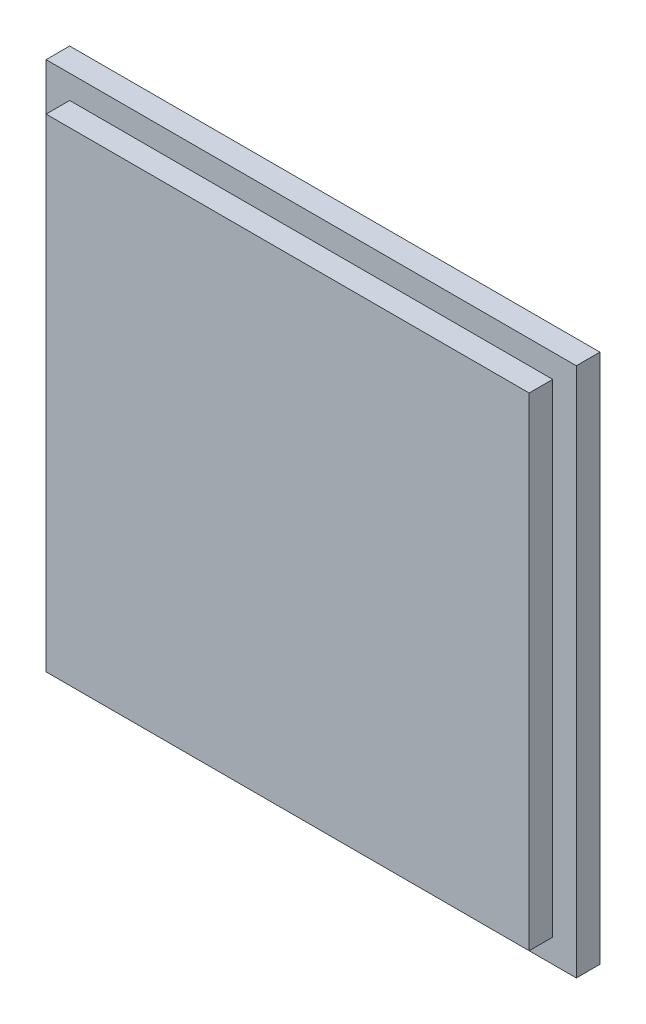
ISO-10303-21;
HEADER;
FILE_DESCRIPTION(('STEP AP214'),'2;1');
FILE_NAME('part.step','',(''),(''),'','','');
FILE_SCHEMA(('AUTOMOTIVE_DESIGN { 1 0 10303 214 1 1 1 1 }'));
ENDSEC;
DATA;
#1=APPLICATION_CONTEXT('core data for automotive mechanical design processes');
#2=APPLICATION_PROTOCOL_DEFINITION('international standard','automotive_design',2000,#1);
#3=PRODUCT_CONTEXT('',#1,'mechanical');
#4=PRODUCT('Part','Part','',(#3));
#5=PRODUCT_RELATED_PRODUCT_CATEGORY('part','',(#4));
#6=PRODUCT_DEFINITION_FORMATION('','',#4);
#7=PRODUCT_DEFINITION_CONTEXT('part definition',#1,'design');
#8=PRODUCT_DEFINITION('design','',#6,#7);
#9=PRODUCT_DEFINITION_SHAPE('','',#8);
#10=(LENGTH_UNIT() NAMED_UNIT(*) SI_UNIT(.MILLI.,.METRE.));
#11=(NAMED_UNIT(*) PLANE_ANGLE_UNIT() SI_UNIT($,.RADIAN.));
#12=(NAMED_UNIT(*) SI_UNIT($,.STERADIAN.) SOLID_ANGLE_UNIT());
#13=UNCERTAINTY_MEASURE_WITH_UNIT(LENGTH_MEASURE(1.E-05),#10,'distance_accuracy_value','');
#14=(GEOMETRIC_REPRESENTATION_CONTEXT(3) GLOBAL_UNCERTAINTY_ASSIGNED_CONTEXT((#13)) GLOBAL_UNIT_ASSIGNED_CONTEXT((#10,
#11,#12)) REPRESENTATION_CONTEXT('',''));
#15=CARTESIAN_POINT('',(0.,0.,0.));
#16=DIRECTION('',(0.,0.,1.));
#17=DIRECTION('',(1.,0.,0.));
#18=AXIS2_PLACEMENT_3D('',#15,#16,#17);
#19=CARTESIAN_POINT('',(0.,0.,1.));
#20=DIRECTION('',(0.,0.,-1.));
#21=DIRECTION('',(-1.,0.,0.));
#22=AXIS2_PLACEMENT_3D('',#19,#20,#21);
#23=PLANE('',#22);
#24=DIRECTION('',(0.500000000000017,0.866025403784429,0.));
#25=VECTOR('',#24,1.);
#26=CARTESIAN_POINT('',(-17.3205080756894,-9.99999999999985,1.));
#27=LINE('',#26,#25);
#28=CARTESIAN_POINT('',(-17.3205080756894,-9.99999999999985,1.));
#29=VERTEX_POINT('',#28);
#30=CARTESIAN_POINT('',(0.,20.,1.));
#31=VERTEX_POINT('',#30);
#32=EDGE_CURVE('E226',#29,#31,#27,.T.);
#33=ORIENTED_EDGE('',*,*,#32,.T.);
#34=DIRECTION('',(0.500000000000007,-0.866025403784434,0.));
#35=VECTOR('',#34,1.);
#36=CARTESIAN_POINT('',(0.,20.,1.));
#37=LINE('',#36,#35);
#38=CARTESIAN_POINT('',(17.3205080756889,-9.99999999999971,1.));
#39=VERTEX_POINT('',#38);
#40=EDGE_CURVE('E230',#31,#39,#37,.T.);
#41=ORIENTED_EDGE('',*,*,#40,.T.);
#42=DIRECTION('',(-1.,0.,0.));
#43=VECTOR('',#42,1.);
#44=CARTESIAN_POINT('',(-17.3205080756894,-9.99999999999985,1.));
#45=LINE('',#44,#43);
#46=EDGE_CURVE('E235',#39,#29,#45,.T.);
#47=ORIENTED_EDGE('',*,*,#46,.T.);
#48=EDGE_LOOP('',(#33,#41,#47));
#49=FACE_BOUND('',#48,.T.);
#50=DIRECTION('',(0.350126618263012,-0.936702381327018,0.));
#51=VECTOR('',#50,1.);
#52=CARTESIAN_POINT('',(1.51775564227952,12.4614953306966,1.));
#53=LINE('',#52,#51);
#54=CARTESIAN_POINT('',(1.51775564227952,12.4614953306966,1.));
#55=VERTEX_POINT('',#54);
#56=CARTESIAN_POINT('',(5.56161090099694,1.64286957360848,1.));
#57=VERTEX_POINT('',#56);
#58=EDGE_CURVE('E588',#55,#57,#53,.T.);
#59=ORIENTED_EDGE('',*,*,#58,.F.);
#60=DIRECTION('',(0.999634969872854,0.0270171613479146,0.));
#61=VECTOR('',#60,1.);
#62=CARTESIAN_POINT('',(-2.3685468141502,12.3564601291715,1.));
#63=LINE('',#62,#61);
#64=CARTESIAN_POINT('',(-2.3685468141502,12.3564601291715,1.));
#65=VERTEX_POINT('',#64);
#66=EDGE_CURVE('E214',#65,#55,#63,.T.);
#67=ORIENTED_EDGE('',*,*,#66,.F.);
#68=DIRECTION('',(-0.459765561217059,0.888040330569937,0.));
#69=VECTOR('',#68,1.);
#70=CARTESIAN_POINT('',(1.46523804151696,4.95147842165001,1.));
#71=LINE('',#70,#69);
#72=CARTESIAN_POINT('',(1.46523804151696,4.95147842165001,1.));
#73=VERTEX_POINT('',#72);
#74=EDGE_CURVE('E210',#73,#65,#71,.T.);
#75=ORIENTED_EDGE('',*,*,#74,.F.);
#76=DIRECTION('',(0.999261174631314,-0.0384331221012039,0.));
#77=VECTOR('',#76,1.);
#78=CARTESIAN_POINT('',(-2.63113481796302,5.1090312239377,1.));
#79=LINE('',#78,#77);
#80=CARTESIAN_POINT('',(-2.63113481796302,5.1090312239377,1.));
#81=VERTEX_POINT('',#80);
#82=EDGE_CURVE('E583',#81,#73,#79,.T.);
#83=ORIENTED_EDGE('',*,*,#82,.F.);
#84=DIRECTION('',(-0.365795626746884,0.930695202229416,0.));
#85=VECTOR('',#84,1.);
#86=CARTESIAN_POINT('',(1.51775564227952,-5.44700652933764,1.));
#87=LINE('',#86,#85);
#88=CARTESIAN_POINT('',(1.51775564227952,-5.44700652933764,1.));
#89=VERTEX_POINT('',#88);
#90=EDGE_CURVE('E614',#89,#81,#87,.T.);
#91=ORIENTED_EDGE('',*,*,#90,.F.);
#92=DIRECTION('',(1.,0.,0.));
#93=VECTOR('',#92,1.);
#94=CARTESIAN_POINT('',(-0.320360384410214,-5.44700652933764,1.));
#95=LINE('',#94,#93);
#96=CARTESIAN_POINT('',(-0.320360384410214,-5.44700652933764,1.));
#97=VERTEX_POINT('',#96);
#98=EDGE_CURVE('E611',#97,#89,#95,.T.);
#99=ORIENTED_EDGE('',*,*,#98,.F.);
#100=DIRECTION('',(-0.776458094390115,0.630168888200673,0.));
#101=VECTOR('',#100,1.);
#102=CARTESIAN_POINT('',(3.3033540682067,-8.38799217204122,1.));
#103=LINE('',#102,#101);
#104=CARTESIAN_POINT('',(3.3033540682067,-8.38799217204122,1.));
#105=VERTEX_POINT('',#104);
#106=EDGE_CURVE('E608',#105,#97,#103,.T.);
#107=ORIENTED_EDGE('',*,*,#106,.F.);
#108=DIRECTION('',(-0.185606774758075,-0.982624101660398,0.));
#109=VECTOR('',#108,1.);
#110=CARTESIAN_POINT('',(4.19615328117028,-3.66140810341047,1.));
#111=LINE('',#110,#109);
#112=CARTESIAN_POINT('',(4.19615328117028,-3.66140810341047,1.));
#113=VERTEX_POINT('',#112);
#114=EDGE_CURVE('E605',#113,#105,#111,.T.);
#115=ORIENTED_EDGE('',*,*,#114,.F.);
#116=DIRECTION('',(0.72138732103095,0.692531828189714,0.));
#117=VECTOR('',#116,1.);
#118=CARTESIAN_POINT('',(2.88321326210618,-4.92183052171201,1.));
#119=LINE('',#118,#117);
#120=CARTESIAN_POINT('',(2.88321326210618,-4.92183052171201,1.));
#121=VERTEX_POINT('',#120);
#122=EDGE_CURVE('E602',#121,#113,#119,.T.);
#123=ORIENTED_EDGE('',*,*,#122,.F.);
#124=DIRECTION('',(0.309649536219728,-0.950850758383726,0.));
#125=VECTOR('',#124,1.);
#126=CARTESIAN_POINT('',(0.574357926212733,2.16804558123412,1.));
#127=LINE('',#126,#125);
#128=CARTESIAN_POINT('',(0.574357926212733,2.16804558123412,1.));
#129=VERTEX_POINT('',#128);
#130=EDGE_CURVE('E599',#129,#121,#127,.T.);
#131=ORIENTED_EDGE('',*,*,#130,.F.);
#132=DIRECTION('',(-0.994501258319248,0.104724625573134,0.));
#133=VECTOR('',#132,1.);
#134=CARTESIAN_POINT('',(5.56161090099694,1.64286957360848,1.));
#135=LINE('',#134,#133);
#136=EDGE_CURVE('E592',#57,#129,#135,.T.);
#137=ORIENTED_EDGE('',*,*,#136,.F.);
#138=EDGE_LOOP('',(#59,#67,#75,#83,#91,#99,#107,#115,#123,#131,#137));
#139=FACE_BOUND('',#138,.T.);
#140=ADVANCED_FACE('F39',(#49,#139),#23,.T.);
#141=CARTESIAN_POINT('',(0.,0.,2.5));
#142=DIRECTION('',(0.,0.,-1.));
#143=DIRECTION('',(-1.,0.,0.));
#144=AXIS2_PLACEMENT_3D('',#141,#142,#143);
#145=PLANE('',#144);
#146=DIRECTION('',(0.,1.,0.));
#147=VECTOR('',#146,1.);
#148=CARTESIAN_POINT('',(28.1,-28.1,2.5));
#149=LINE('',#148,#147);
#150=CARTESIAN_POINT('',(28.1,-28.1,2.5));
#151=VERTEX_POINT('',#150);
#152=CARTESIAN_POINT('',(28.1,28.1,2.5));
#153=VERTEX_POINT('',#152);
#154=EDGE_CURVE('E300',#151,#153,#149,.T.);
#155=ORIENTED_EDGE('',*,*,#154,.T.);
#156=DIRECTION('',(-1.,0.,0.));
#157=VECTOR('',#156,1.);
#158=CARTESIAN_POINT('',(-28.1,28.1,2.5));
#159=LINE('',#158,#157);
#160=CARTESIAN_POINT('',(-28.1,28.1,2.5));
#161=VERTEX_POINT('',#160);
#162=EDGE_CURVE('E304',#153,#161,#159,.T.);
#163=ORIENTED_EDGE('',*,*,#162,.T.);
#164=DIRECTION('',(0.,-1.,0.));
#165=VECTOR('',#164,1.);
#166=CARTESIAN_POINT('',(-28.1,-28.1,2.5));
#167=LINE('',#166,#165);
#168=CARTESIAN_POINT('',(-28.1,-28.1,2.5));
#169=VERTEX_POINT('',#168);
#170=EDGE_CURVE('E308',#161,#169,#167,.T.);
#171=ORIENTED_EDGE('',*,*,#170,.T.);
#172=DIRECTION('',(1.,0.,0.));
#173=VECTOR('',#172,1.);
#174=CARTESIAN_POINT('',(-28.1,-28.1,2.5));
#175=LINE('',#174,#173);
#176=EDGE_CURVE('E311',#169,#151,#175,.T.);
#177=ORIENTED_EDGE('',*,*,#176,.T.);
#178=EDGE_LOOP('',(#155,#163,#171,#177));
#179=FACE_BOUND('',#178,.T.);
#180=DIRECTION('',(0.,1.,0.));
#181=VECTOR('',#180,1.);
#182=CARTESIAN_POINT('',(25.6,-25.6,2.5));
#183=LINE('',#182,#181);
#184=CARTESIAN_POINT('',(25.6,-25.6,2.5));
#185=VERTEX_POINT('',#184);
#186=CARTESIAN_POINT('',(25.6,25.6,2.5));
#187=VERTEX_POINT('',#186);
#188=EDGE_CURVE('E249',#185,#187,#183,.T.);
#189=ORIENTED_EDGE('',*,*,#188,.F.);
#190=DIRECTION('',(1.,0.,0.));
#191=VECTOR('',#190,1.);
#192=CARTESIAN_POINT('',(-25.6,-25.6,2.5));
#193=LINE('',#192,#191);
#194=CARTESIAN_POINT('',(-25.6,-25.6,2.5));
#195=VERTEX_POINT('',#194);
#196=EDGE_CURVE('E260',#195,#185,#193,.T.);
#197=ORIENTED_EDGE('',*,*,#196,.F.);
#198=DIRECTION('',(0.,-1.,0.));
#199=VECTOR('',#198,1.);
#200=CARTESIAN_POINT('',(-25.6,-25.6,2.5));
#201=LINE('',#200,#199);
#202=CARTESIAN_POINT('',(-25.6,25.6,2.5));
#203=VERTEX_POINT('',#202);
#204=EDGE_CURVE('E277',#203,#195,#201,.T.);
#205=ORIENTED_EDGE('',*,*,#204,.F.);
#206=DIRECTION('',(-1.,0.,0.));
#207=VECTOR('',#206,1.);
#208=CARTESIAN_POINT('',(-25.6,25.6,2.5));
#209=LINE('',#208,#207);
#210=EDGE_CURVE('E273',#187,#203,#209,.T.);
#211=ORIENTED_EDGE('',*,*,#210,.F.);
#212=EDGE_LOOP('',(#189,#197,#205,#211));
#213=FACE_BOUND('',#212,.T.);
#214=ADVANCED_FACE('F353',(#179,#213),#145,.F.);
#215=CARTESIAN_POINT('',(28.1,-28.1,2.5));
#216=DIRECTION('',(-1.,0.,0.));
#217=DIRECTION('',(0.,0.,1.));
#218=AXIS2_PLACEMENT_3D('',#215,#216,#217);
#219=PLANE('',#218);
#220=DIRECTION('',(0.,1.,0.));
#221=VECTOR('',#220,1.);
#222=CARTESIAN_POINT('',(28.1,-28.1,0.));
#223=LINE('',#222,#221);
#224=CARTESIAN_POINT('',(28.1,-28.1,0.));
#225=VERTEX_POINT('',#224);
#226=CARTESIAN_POINT('',(28.1,28.1,0.));
#227=VERTEX_POINT('',#226);
#228=EDGE_CURVE('E299',#225,#227,#223,.T.);
#229=ORIENTED_EDGE('',*,*,#228,.T.);
#230=DIRECTION('',(0.,0.,-1.));
#231=VECTOR('',#230,1.);
#232=CARTESIAN_POINT('',(28.1,28.1,2.5));
#233=LINE('',#232,#231);
#234=EDGE_CURVE('E11',#153,#227,#233,.T.);
#235=ORIENTED_EDGE('',*,*,#234,.F.);
#236=ORIENTED_EDGE('',*,*,#154,.F.);
#237=DIRECTION('',(0.,0.,-1.));
#238=VECTOR('',#237,1.);
#239=CARTESIAN_POINT('',(28.1,-28.1,2.5));
#240=LINE('',#239,#238);
#241=EDGE_CURVE('E314',#151,#225,#240,.T.);
#242=ORIENTED_EDGE('',*,*,#241,.T.);
#243=EDGE_LOOP('',(#229,#235,#236,#242));
#244=FACE_BOUND('',#243,.T.);
#245=ADVANCED_FACE('F41',(#244),#219,.F.);
#246=CARTESIAN_POINT('',(-28.1,28.1,2.5));
#247=DIRECTION('',(0.,-1.,0.));
#248=DIRECTION('',(0.,0.,-1.));
#249=AXIS2_PLACEMENT_3D('',#246,#247,#248);
#250=PLANE('',#249);
#251=DIRECTION('',(-1.,0.,0.));
#252=VECTOR('',#251,1.);
#253=CARTESIAN_POINT('',(-28.1,28.1,0.));
#254=LINE('',#253,#252);
#255=CARTESIAN_POINT('',(-28.1,28.1,0.));
#256=VERTEX_POINT('',#255);
#257=EDGE_CURVE('E318',#227,#256,#254,.T.);
#258=ORIENTED_EDGE('',*,*,#257,.T.);
#259=DIRECTION('',(0.,0.,-1.));
#260=VECTOR('',#259,1.);
#261=CARTESIAN_POINT('',(-28.1,28.1,2.5));
#262=LINE('',#261,#260);
#263=EDGE_CURVE('E48',#161,#256,#262,.T.);
#264=ORIENTED_EDGE('',*,*,#263,.F.);
#265=ORIENTED_EDGE('',*,*,#162,.F.);
#266=ORIENTED_EDGE('',*,*,#234,.T.);
#267=EDGE_LOOP('',(#258,#264,#265,#266));
#268=FACE_BOUND('',#267,.T.);
#269=ADVANCED_FACE('F355',(#268),#250,.F.);
#270=CARTESIAN_POINT('',(-28.1,-28.1,2.5));
#271=DIRECTION('',(1.,0.,0.));
#272=DIRECTION('',(0.,0.,-1.));
#273=AXIS2_PLACEMENT_3D('',#270,#271,#272);
#274=PLANE('',#273);
#275=DIRECTION('',(0.,-1.,0.));
#276=VECTOR('',#275,1.);
#277=CARTESIAN_POINT('',(-28.1,-28.1,0.));
#278=LINE('',#277,#276);
#279=CARTESIAN_POINT('',(-28.1,-28.1,0.));
#280=VERTEX_POINT('',#279);
#281=EDGE_CURVE('E321',#256,#280,#278,.T.);
#282=ORIENTED_EDGE('',*,*,#281,.T.);
#283=DIRECTION('',(0.,0.,-1.));
#284=VECTOR('',#283,1.);
#285=CARTESIAN_POINT('',(-28.1,-28.1,2.5));
#286=LINE('',#285,#284);
#287=EDGE_CURVE('E329',#169,#280,#286,.T.);
#288=ORIENTED_EDGE('',*,*,#287,.F.);
#289=ORIENTED_EDGE('',*,*,#170,.F.);
#290=ORIENTED_EDGE('',*,*,#263,.T.);
#291=EDGE_LOOP('',(#282,#288,#289,#290));
#292=FACE_BOUND('',#291,.T.);
#293=ADVANCED_FACE('F338',(#292),#274,.F.);
#294=CARTESIAN_POINT('',(-28.1,-28.1,2.5));
#295=DIRECTION('',(0.,1.,0.));
#296=DIRECTION('',(-1.,0.,0.));
#297=AXIS2_PLACEMENT_3D('',#294,#295,#296);
#298=PLANE('',#297);
#299=DIRECTION('',(1.,0.,0.));
#300=VECTOR('',#299,1.);
#301=CARTESIAN_POINT('',(-28.1,-28.1,0.));
#302=LINE('',#301,#300);
#303=EDGE_CURVE('E305',#280,#225,#302,.T.);
#304=ORIENTED_EDGE('',*,*,#303,.T.);
#305=ORIENTED_EDGE('',*,*,#241,.F.);
#306=ORIENTED_EDGE('',*,*,#176,.F.);
#307=ORIENTED_EDGE('',*,*,#287,.T.);
#308=EDGE_LOOP('',(#304,#305,#306,#307));
#309=FACE_BOUND('',#308,.T.);
#310=ADVANCED_FACE('F347',(#309),#298,.F.);
#311=CARTESIAN_POINT('',(0.,0.,0.));
#312=DIRECTION('',(0.,0.,-1.));
#313=DIRECTION('',(-1.,0.,0.));
#314=AXIS2_PLACEMENT_3D('',#311,#312,#313);
#315=PLANE('',#314);
#316=DIRECTION('',(0.500000000000017,0.866025403784429,0.));
#317=VECTOR('',#316,1.);
#318=CARTESIAN_POINT('',(-17.3205080756894,-9.99999999999985,0.));
#319=LINE('',#318,#317);
#320=CARTESIAN_POINT('',(-17.3205080756894,-9.99999999999985,0.));
#321=VERTEX_POINT('',#320);
#322=CARTESIAN_POINT('',(0.,20.,0.));
#323=VERTEX_POINT('',#322);
#324=EDGE_CURVE('E63',#321,#323,#319,.T.);
#325=ORIENTED_EDGE('',*,*,#324,.F.);
#326=DIRECTION('',(-1.,0.,0.));
#327=VECTOR('',#326,1.);
#328=CARTESIAN_POINT('',(-17.3205080756894,-9.99999999999985,0.));
#329=LINE('',#328,#327);
#330=CARTESIAN_POINT('',(17.3205080756889,-9.99999999999971,0.));
#331=VERTEX_POINT('',#330);
#332=EDGE_CURVE('E231',#331,#321,#329,.T.);
#333=ORIENTED_EDGE('',*,*,#332,.F.);
#334=DIRECTION('',(0.500000000000007,-0.866025403784434,0.));
#335=VECTOR('',#334,1.);
#336=CARTESIAN_POINT('',(0.,20.,0.));
#337=LINE('',#336,#335);
#338=EDGE_CURVE('E220',#323,#331,#337,.T.);
#339=ORIENTED_EDGE('',*,*,#338,.F.);
#340=EDGE_LOOP('',(#325,#333,#339));
#341=FACE_BOUND('',#340,.T.);
#342=ORIENTED_EDGE('',*,*,#228,.F.);
#343=ORIENTED_EDGE('',*,*,#303,.F.);
#344=ORIENTED_EDGE('',*,*,#281,.F.);
#345=ORIENTED_EDGE('',*,*,#257,.F.);
#346=EDGE_LOOP('',(#342,#343,#344,#345));
#347=FACE_BOUND('',#346,.T.);
#348=ADVANCED_FACE('F344',(#341,#347),#315,.T.);
#349=CARTESIAN_POINT('',(25.6,-25.6,5.));
#350=DIRECTION('',(-1.,0.,0.));
#351=DIRECTION('',(0.,0.,1.));
#352=AXIS2_PLACEMENT_3D('',#349,#350,#351);
#353=PLANE('',#352);
#354=ORIENTED_EDGE('',*,*,#188,.T.);
#355=DIRECTION('',(0.,0.,-1.));
#356=VECTOR('',#355,1.);
#357=CARTESIAN_POINT('',(25.6,25.6,5.));
#358=LINE('',#357,#356);
#359=CARTESIAN_POINT('',(25.6,25.6,5.));
#360=VERTEX_POINT('',#359);
#361=EDGE_CURVE('E295',#360,#187,#358,.T.);
#362=ORIENTED_EDGE('',*,*,#361,.F.);
#363=DIRECTION('',(0.,1.,0.));
#364=VECTOR('',#363,1.);
#365=CARTESIAN_POINT('',(25.6,-25.6,5.));
#366=LINE('',#365,#364);
#367=CARTESIAN_POINT('',(25.6,-25.6,5.));
#368=VERTEX_POINT('',#367);
#369=EDGE_CURVE('E255',#368,#360,#366,.T.);
#370=ORIENTED_EDGE('',*,*,#369,.F.);
#371=DIRECTION('',(0.,0.,-1.));
#372=VECTOR('',#371,1.);
#373=CARTESIAN_POINT('',(25.6,-25.6,5.));
#374=LINE('',#373,#372);
#375=EDGE_CURVE('E269',#368,#185,#374,.T.);
#376=ORIENTED_EDGE('',*,*,#375,.T.);
#377=EDGE_LOOP('',(#354,#362,#370,#376));
#378=FACE_BOUND('',#377,.T.);
#379=ADVANCED_FACE('F399',(#378),#353,.F.);
#380=CARTESIAN_POINT('',(-25.6,25.6,5.));
#381=DIRECTION('',(0.,-1.,0.));
#382=DIRECTION('',(0.,0.,-1.));
#383=AXIS2_PLACEMENT_3D('',#380,#381,#382);
#384=PLANE('',#383);
#385=ORIENTED_EDGE('',*,*,#210,.T.);
#386=DIRECTION('',(0.,0.,-1.));
#387=VECTOR('',#386,1.);
#388=CARTESIAN_POINT('',(-25.6,25.6,5.));
#389=LINE('',#388,#387);
#390=CARTESIAN_POINT('',(-25.6,25.6,5.));
#391=VERTEX_POINT('',#390);
#392=EDGE_CURVE('E291',#391,#203,#389,.T.);
#393=ORIENTED_EDGE('',*,*,#392,.F.);
#394=DIRECTION('',(-1.,0.,0.));
#395=VECTOR('',#394,1.);
#396=CARTESIAN_POINT('',(-25.6,25.6,5.));
#397=LINE('',#396,#395);
#398=EDGE_CURVE('E259',#360,#391,#397,.T.);
#399=ORIENTED_EDGE('',*,*,#398,.F.);
#400=ORIENTED_EDGE('',*,*,#361,.T.);
#401=EDGE_LOOP('',(#385,#393,#399,#400));
#402=FACE_BOUND('',#401,.T.);
#403=ADVANCED_FACE('F395',(#402),#384,.F.);
#404=CARTESIAN_POINT('',(-25.6,-25.6,5.));
#405=DIRECTION('',(1.,0.,0.));
#406=DIRECTION('',(0.,0.,-1.));
#407=AXIS2_PLACEMENT_3D('',#404,#405,#406);
#408=PLANE('',#407);
#409=ORIENTED_EDGE('',*,*,#204,.T.);
#410=DIRECTION('',(0.,0.,-1.));
#411=VECTOR('',#410,1.);
#412=CARTESIAN_POINT('',(-25.6,-25.6,5.));
#413=LINE('',#412,#411);
#414=CARTESIAN_POINT('',(-25.6,-25.6,5.));
#415=VERTEX_POINT('',#414);
#416=EDGE_CURVE('E287',#415,#195,#413,.T.);
#417=ORIENTED_EDGE('',*,*,#416,.F.);
#418=DIRECTION('',(0.,-1.,0.));
#419=VECTOR('',#418,1.);
#420=CARTESIAN_POINT('',(-25.6,-25.6,5.));
#421=LINE('',#420,#419);
#422=EDGE_CURVE('E263',#391,#415,#421,.T.);
#423=ORIENTED_EDGE('',*,*,#422,.F.);
#424=ORIENTED_EDGE('',*,*,#392,.T.);
#425=EDGE_LOOP('',(#409,#417,#423,#424));
#426=FACE_BOUND('',#425,.T.);
#427=ADVANCED_FACE('F391',(#426),#408,.F.);
#428=CARTESIAN_POINT('',(-25.6,-25.6,5.));
#429=DIRECTION('',(0.,1.,0.));
#430=DIRECTION('',(0.,0.,1.));
#431=AXIS2_PLACEMENT_3D('',#428,#429,#430);
#432=PLANE('',#431);
#433=ORIENTED_EDGE('',*,*,#196,.T.);
#434=ORIENTED_EDGE('',*,*,#375,.F.);
#435=DIRECTION('',(1.,0.,0.));
#436=VECTOR('',#435,1.);
#437=CARTESIAN_POINT('',(-25.6,-25.6,5.));
#438=LINE('',#437,#436);
#439=EDGE_CURVE('E266',#415,#368,#438,.T.);
#440=ORIENTED_EDGE('',*,*,#439,.F.);
#441=ORIENTED_EDGE('',*,*,#416,.T.);
#442=EDGE_LOOP('',(#433,#434,#440,#441));
#443=FACE_BOUND('',#442,.T.);
#444=ADVANCED_FACE('F387',(#443),#432,.F.);
#445=CARTESIAN_POINT('',(0.,0.,5.));
#446=DIRECTION('',(0.,0.,-1.));
#447=DIRECTION('',(-1.,0.,0.));
#448=AXIS2_PLACEMENT_3D('',#445,#446,#447);
#449=PLANE('',#448);
#450=ORIENTED_EDGE('',*,*,#369,.T.);
#451=ORIENTED_EDGE('',*,*,#398,.T.);
#452=ORIENTED_EDGE('',*,*,#422,.T.);
#453=ORIENTED_EDGE('',*,*,#439,.T.);
#454=EDGE_LOOP('',(#450,#451,#452,#453));
#455=FACE_BOUND('',#454,.T.);
#456=ADVANCED_FACE('F385',(#455),#449,.F.);
#457=CARTESIAN_POINT('',(-17.3205080756894,-9.99999999999985,1.));
#458=DIRECTION('',(-0.866025403784429,0.500000000000017,0.));
#459=DIRECTION('',(-0.500000000000017,-0.866025403784429,0.));
#460=AXIS2_PLACEMENT_3D('',#457,#458,#459);
#461=PLANE('',#460);
#462=ORIENTED_EDGE('',*,*,#324,.T.);
#463=DIRECTION('',(0.,0.,-1.));
#464=VECTOR('',#463,1.);
#465=CARTESIAN_POINT('',(0.,20.,1.));
#466=LINE('',#465,#464);
#467=EDGE_CURVE('E238',#31,#323,#466,.T.);
#468=ORIENTED_EDGE('',*,*,#467,.F.);
#469=ORIENTED_EDGE('',*,*,#32,.F.);
#470=DIRECTION('',(0.,0.,-1.));
#471=VECTOR('',#470,1.);
#472=CARTESIAN_POINT('',(-17.3205080756894,-9.99999999999985,1.));
#473=LINE('',#472,#471);
#474=EDGE_CURVE('E246',#29,#321,#473,.T.);
#475=ORIENTED_EDGE('',*,*,#474,.T.);
#476=EDGE_LOOP('',(#462,#468,#469,#475));
#477=FACE_BOUND('',#476,.T.);
#478=ADVANCED_FACE('F379',(#477),#461,.F.);
#479=CARTESIAN_POINT('',(-17.3205080756894,-9.99999999999985,1.));
#480=DIRECTION('',(0.,-1.,0.));
#481=DIRECTION('',(1.,0.,0.));
#482=AXIS2_PLACEMENT_3D('',#479,#480,#481);
#483=PLANE('',#482);
#484=ORIENTED_EDGE('',*,*,#332,.T.);
#485=ORIENTED_EDGE('',*,*,#474,.F.);
#486=ORIENTED_EDGE('',*,*,#46,.F.);
#487=DIRECTION('',(0.,0.,-1.));
#488=VECTOR('',#487,1.);
#489=CARTESIAN_POINT('',(17.3205080756889,-9.99999999999971,1.));
#490=LINE('',#489,#488);
#491=EDGE_CURVE('E250',#39,#331,#490,.T.);
#492=ORIENTED_EDGE('',*,*,#491,.T.);
#493=EDGE_LOOP('',(#484,#485,#486,#492));
#494=FACE_BOUND('',#493,.T.);
#495=ADVANCED_FACE('F375',(#494),#483,.F.);
#496=CARTESIAN_POINT('',(0.,20.,1.));
#497=DIRECTION('',(0.866025403784434,0.500000000000007,0.));
#498=DIRECTION('',(-0.500000000000007,0.866025403784435,0.));
#499=AXIS2_PLACEMENT_3D('',#496,#497,#498);
#500=PLANE('',#499);
#501=ORIENTED_EDGE('',*,*,#338,.T.);
#502=ORIENTED_EDGE('',*,*,#491,.F.);
#503=ORIENTED_EDGE('',*,*,#40,.F.);
#504=ORIENTED_EDGE('',*,*,#467,.T.);
#505=EDGE_LOOP('',(#501,#502,#503,#504));
#506=FACE_BOUND('',#505,.T.);
#507=ADVANCED_FACE('F378',(#506),#500,.F.);
#508=CARTESIAN_POINT('',(-2.3685468141502,12.3564601291715,0.));
#509=DIRECTION('',(0.0270171613479146,-0.999634969872854,0.));
#510=DIRECTION('',(0.999634969872854,0.0270171613479146,0.));
#511=AXIS2_PLACEMENT_3D('',#508,#509,#510);
#512=PLANE('',#511);
#513=ORIENTED_EDGE('',*,*,#66,.T.);
#514=DIRECTION('',(0.,0.,1.));
#515=VECTOR('',#514,1.);
#516=CARTESIAN_POINT('',(1.51775564227952,12.4614953306966,0.));
#517=LINE('',#516,#515);
#518=CARTESIAN_POINT('',(1.51775564227952,12.4614953306966,0.));
#519=VERTEX_POINT('',#518);
#520=EDGE_CURVE('E193',#519,#55,#517,.T.);
#521=ORIENTED_EDGE('',*,*,#520,.F.);
#522=DIRECTION('',(0.999634969872854,0.0270171613479146,0.));
#523=VECTOR('',#522,1.);
#524=CARTESIAN_POINT('',(-2.3685468141502,12.3564601291715,0.));
#525=LINE('',#524,#523);
#526=CARTESIAN_POINT('',(-2.3685468141502,12.3564601291715,0.));
#527=VERTEX_POINT('',#526);
#528=EDGE_CURVE('E201',#527,#519,#525,.T.);
#529=ORIENTED_EDGE('',*,*,#528,.F.);
#530=DIRECTION('',(0.,0.,1.));
#531=VECTOR('',#530,1.);
#532=CARTESIAN_POINT('',(-2.3685468141502,12.3564601291715,0.));
#533=LINE('',#532,#531);
#534=EDGE_CURVE('E580',#527,#65,#533,.T.);
#535=ORIENTED_EDGE('',*,*,#534,.T.);
#536=EDGE_LOOP('',(#513,#521,#529,#535));
#537=FACE_BOUND('',#536,.T.);
#538=ADVANCED_FACE('F212',(#537),#512,.F.);
#539=CARTESIAN_POINT('',(1.51775564227952,12.4614953306966,0.));
#540=DIRECTION('',(-0.936702381327018,-0.350126618263012,0.));
#541=DIRECTION('',(0.350126618263012,-0.936702381327018,0.));
#542=AXIS2_PLACEMENT_3D('',#539,#540,#541);
#543=PLANE('',#542);
#544=ORIENTED_EDGE('',*,*,#58,.T.);
#545=DIRECTION('',(0.,0.,1.));
#546=VECTOR('',#545,1.);
#547=CARTESIAN_POINT('',(5.56161090099694,1.64286957360848,0.));
#548=LINE('',#547,#546);
#549=CARTESIAN_POINT('',(5.56161090099694,1.64286957360848,0.));
#550=VERTEX_POINT('',#549);
#551=EDGE_CURVE('E196',#550,#57,#548,.T.);
#552=ORIENTED_EDGE('',*,*,#551,.F.);
#553=DIRECTION('',(0.350126618263012,-0.936702381327018,0.));
#554=VECTOR('',#553,1.);
#555=CARTESIAN_POINT('',(1.51775564227952,12.4614953306966,0.));
#556=LINE('',#555,#554);
#557=EDGE_CURVE('E189',#519,#550,#556,.T.);
#558=ORIENTED_EDGE('',*,*,#557,.F.);
#559=ORIENTED_EDGE('',*,*,#520,.T.);
#560=EDGE_LOOP('',(#544,#552,#558,#559));
#561=FACE_BOUND('',#560,.T.);
#562=ADVANCED_FACE('F191',(#561),#543,.F.);
#563=CARTESIAN_POINT('',(5.56161090099694,1.64286957360848,0.));
#564=DIRECTION('',(0.104724625573134,0.994501258319248,0.));
#565=DIRECTION('',(-0.994501258319248,0.104724625573134,0.));
#566=AXIS2_PLACEMENT_3D('',#563,#564,#565);
#567=PLANE('',#566);
#568=ORIENTED_EDGE('',*,*,#136,.T.);
#569=DIRECTION('',(0.,0.,1.));
#570=VECTOR('',#569,1.);
#571=CARTESIAN_POINT('',(0.574357926212733,2.16804558123412,0.));
#572=LINE('',#571,#570);
#573=CARTESIAN_POINT('',(0.574357926212733,2.16804558123412,0.));
#574=VERTEX_POINT('',#573);
#575=EDGE_CURVE('E222',#574,#129,#572,.T.);
#576=ORIENTED_EDGE('',*,*,#575,.F.);
#577=DIRECTION('',(-0.994501258319248,0.104724625573134,0.));
#578=VECTOR('',#577,1.);
#579=CARTESIAN_POINT('',(5.56161090099694,1.64286957360848,0.));
#580=LINE('',#579,#578);
#581=EDGE_CURVE('E200',#550,#574,#580,.T.);
#582=ORIENTED_EDGE('',*,*,#581,.F.);
#583=ORIENTED_EDGE('',*,*,#551,.T.);
#584=EDGE_LOOP('',(#568,#576,#582,#583));
#585=FACE_BOUND('',#584,.T.);
#586=ADVANCED_FACE('F477',(#585),#567,.F.);
#587=CARTESIAN_POINT('',(0.574357926212733,2.16804558123412,0.));
#588=DIRECTION('',(-0.950850758383726,-0.309649536219728,0.));
#589=DIRECTION('',(0.309649536219728,-0.950850758383726,0.));
#590=AXIS2_PLACEMENT_3D('',#587,#588,#589);
#591=PLANE('',#590);
#592=ORIENTED_EDGE('',*,*,#130,.T.);
#593=DIRECTION('',(0.,0.,1.));
#594=VECTOR('',#593,1.);
#595=CARTESIAN_POINT('',(2.88321326210618,-4.92183052171201,0.));
#596=LINE('',#595,#594);
#597=CARTESIAN_POINT('',(2.88321326210618,-4.92183052171201,0.));
#598=VERTEX_POINT('',#597);
#599=EDGE_CURVE('E641',#598,#121,#596,.T.);
#600=ORIENTED_EDGE('',*,*,#599,.F.);
#601=DIRECTION('',(0.309649536219728,-0.950850758383726,0.));
#602=VECTOR('',#601,1.);
#603=CARTESIAN_POINT('',(0.574357926212733,2.16804558123412,0.));
#604=LINE('',#603,#602);
#605=EDGE_CURVE('E650',#574,#598,#604,.T.);
#606=ORIENTED_EDGE('',*,*,#605,.F.);
#607=ORIENTED_EDGE('',*,*,#575,.T.);
#608=EDGE_LOOP('',(#592,#600,#606,#607));
#609=FACE_BOUND('',#608,.T.);
#610=ADVANCED_FACE('F484',(#609),#591,.F.);
#611=CARTESIAN_POINT('',(2.88321326210618,-4.92183052171201,0.));
#612=DIRECTION('',(0.692531828189714,-0.72138732103095,0.));
#613=DIRECTION('',(0.721387321030951,0.692531828189715,0.));
#614=AXIS2_PLACEMENT_3D('',#611,#612,#613);
#615=PLANE('',#614);
#616=ORIENTED_EDGE('',*,*,#122,.T.);
#617=DIRECTION('',(0.,0.,1.));
#618=VECTOR('',#617,1.);
#619=CARTESIAN_POINT('',(4.19615328117028,-3.66140810341047,0.));
#620=LINE('',#619,#618);
#621=CARTESIAN_POINT('',(4.19615328117028,-3.66140810341047,0.));
#622=VERTEX_POINT('',#621);
#623=EDGE_CURVE('E637',#622,#113,#620,.T.);
#624=ORIENTED_EDGE('',*,*,#623,.F.);
#625=DIRECTION('',(0.72138732103095,0.692531828189714,0.));
#626=VECTOR('',#625,1.);
#627=CARTESIAN_POINT('',(2.88321326210618,-4.92183052171201,0.));
#628=LINE('',#627,#626);
#629=EDGE_CURVE('E662',#598,#622,#628,.T.);
#630=ORIENTED_EDGE('',*,*,#629,.F.);
#631=ORIENTED_EDGE('',*,*,#599,.T.);
#632=EDGE_LOOP('',(#616,#624,#630,#631));
#633=FACE_BOUND('',#632,.T.);
#634=ADVANCED_FACE('F493',(#633),#615,.F.);
#635=CARTESIAN_POINT('',(4.19615328117028,-3.66140810341047,0.));
#636=DIRECTION('',(-0.982624101660398,0.185606774758075,0.));
#637=DIRECTION('',(-0.185606774758075,-0.982624101660399,0.));
#638=AXIS2_PLACEMENT_3D('',#635,#636,#637);
#639=PLANE('',#638);
#640=ORIENTED_EDGE('',*,*,#114,.T.);
#641=DIRECTION('',(0.,0.,1.));
#642=VECTOR('',#641,1.);
#643=CARTESIAN_POINT('',(3.3033540682067,-8.38799217204122,0.));
#644=LINE('',#643,#642);
#645=CARTESIAN_POINT('',(3.3033540682067,-8.38799217204122,0.));
#646=VERTEX_POINT('',#645);
#647=EDGE_CURVE('E633',#646,#105,#644,.T.);
#648=ORIENTED_EDGE('',*,*,#647,.F.);
#649=DIRECTION('',(-0.185606774758075,-0.982624101660398,0.));
#650=VECTOR('',#649,1.);
#651=CARTESIAN_POINT('',(4.19615328117028,-3.66140810341047,0.));
#652=LINE('',#651,#650);
#653=EDGE_CURVE('E658',#622,#646,#652,.T.);
#654=ORIENTED_EDGE('',*,*,#653,.F.);
#655=ORIENTED_EDGE('',*,*,#623,.T.);
#656=EDGE_LOOP('',(#640,#648,#654,#655));
#657=FACE_BOUND('',#656,.T.);
#658=ADVANCED_FACE('F502',(#657),#639,.F.);
#659=CARTESIAN_POINT('',(3.3033540682067,-8.38799217204122,0.));
#660=DIRECTION('',(0.630168888200673,0.776458094390115,0.));
#661=DIRECTION('',(-0.776458094390115,0.630168888200673,0.));
#662=AXIS2_PLACEMENT_3D('',#659,#660,#661);
#663=PLANE('',#662);
#664=ORIENTED_EDGE('',*,*,#106,.T.);
#665=DIRECTION('',(0.,0.,1.));
#666=VECTOR('',#665,1.);
#667=CARTESIAN_POINT('',(-0.320360384410214,-5.44700652933764,0.));
#668=LINE('',#667,#666);
#669=CARTESIAN_POINT('',(-0.320360384410214,-5.44700652933764,0.));
#670=VERTEX_POINT('',#669);
#671=EDGE_CURVE('E629',#670,#97,#668,.T.);
#672=ORIENTED_EDGE('',*,*,#671,.F.);
#673=DIRECTION('',(-0.776458094390115,0.630168888200673,0.));
#674=VECTOR('',#673,1.);
#675=CARTESIAN_POINT('',(3.3033540682067,-8.38799217204122,0.));
#676=LINE('',#675,#674);
#677=EDGE_CURVE('E661',#646,#670,#676,.T.);
#678=ORIENTED_EDGE('',*,*,#677,.F.);
#679=ORIENTED_EDGE('',*,*,#647,.T.);
#680=EDGE_LOOP('',(#664,#672,#678,#679));
#681=FACE_BOUND('',#680,.T.);
#682=ADVANCED_FACE('F511',(#681),#663,.F.);
#683=CARTESIAN_POINT('',(-0.320360384410214,-5.44700652933764,0.));
#684=DIRECTION('',(0.,-1.,0.));
#685=DIRECTION('',(0.,0.,-1.));
#686=AXIS2_PLACEMENT_3D('',#683,#684,#685);
#687=PLANE('',#686);
#688=ORIENTED_EDGE('',*,*,#98,.T.);
#689=DIRECTION('',(0.,0.,1.));
#690=VECTOR('',#689,1.);
#691=CARTESIAN_POINT('',(1.51775564227952,-5.44700652933764,0.));
#692=LINE('',#691,#690);
#693=CARTESIAN_POINT('',(1.51775564227952,-5.44700652933764,0.));
#694=VERTEX_POINT('',#693);
#695=EDGE_CURVE('E625',#694,#89,#692,.T.);
#696=ORIENTED_EDGE('',*,*,#695,.F.);
#697=DIRECTION('',(1.,0.,0.));
#698=VECTOR('',#697,1.);
#699=CARTESIAN_POINT('',(-0.320360384410214,-5.44700652933764,0.));
#700=LINE('',#699,#698);
#701=EDGE_CURVE('E666',#670,#694,#700,.T.);
#702=ORIENTED_EDGE('',*,*,#701,.F.);
#703=ORIENTED_EDGE('',*,*,#671,.T.);
#704=EDGE_LOOP('',(#688,#696,#702,#703));
#705=FACE_BOUND('',#704,.T.);
#706=ADVANCED_FACE('F520',(#705),#687,.F.);
#707=CARTESIAN_POINT('',(1.51775564227952,-5.44700652933764,0.));
#708=DIRECTION('',(0.930695202229416,0.365795626746884,0.));
#709=DIRECTION('',(-0.365795626746884,0.930695202229416,0.));
#710=AXIS2_PLACEMENT_3D('',#707,#708,#709);
#711=PLANE('',#710);
#712=ORIENTED_EDGE('',*,*,#90,.T.);
#713=DIRECTION('',(0.,0.,1.));
#714=VECTOR('',#713,1.);
#715=CARTESIAN_POINT('',(-2.63113481796302,5.1090312239377,0.));
#716=LINE('',#715,#714);
#717=CARTESIAN_POINT('',(-2.63113481796302,5.1090312239377,0.));
#718=VERTEX_POINT('',#717);
#719=EDGE_CURVE('E621',#718,#81,#716,.T.);
#720=ORIENTED_EDGE('',*,*,#719,.F.);
#721=DIRECTION('',(-0.365795626746884,0.930695202229416,0.));
#722=VECTOR('',#721,1.);
#723=CARTESIAN_POINT('',(1.51775564227952,-5.44700652933764,0.));
#724=LINE('',#723,#722);
#725=EDGE_CURVE('E673',#694,#718,#724,.T.);
#726=ORIENTED_EDGE('',*,*,#725,.F.);
#727=ORIENTED_EDGE('',*,*,#695,.T.);
#728=EDGE_LOOP('',(#712,#720,#726,#727));
#729=FACE_BOUND('',#728,.T.);
#730=ADVANCED_FACE('F529',(#729),#711,.F.);
#731=CARTESIAN_POINT('',(-2.63113481796302,5.1090312239377,0.));
#732=DIRECTION('',(-0.0384331221012039,-0.999261174631314,0.));
#733=DIRECTION('',(0.999261174631314,-0.0384331221012039,0.));
#734=AXIS2_PLACEMENT_3D('',#731,#732,#733);
#735=PLANE('',#734);
#736=ORIENTED_EDGE('',*,*,#82,.T.);
#737=DIRECTION('',(0.,0.,1.));
#738=VECTOR('',#737,1.);
#739=CARTESIAN_POINT('',(1.46523804151696,4.95147842165001,0.));
#740=LINE('',#739,#738);
#741=CARTESIAN_POINT('',(1.46523804151696,4.95147842165001,0.));
#742=VERTEX_POINT('',#741);
#743=EDGE_CURVE('E55',#742,#73,#740,.T.);
#744=ORIENTED_EDGE('',*,*,#743,.F.);
#745=DIRECTION('',(0.999261174631314,-0.0384331221012039,0.));
#746=VECTOR('',#745,1.);
#747=CARTESIAN_POINT('',(-2.63113481796302,5.1090312239377,0.));
#748=LINE('',#747,#746);
#749=EDGE_CURVE('E675',#718,#742,#748,.T.);
#750=ORIENTED_EDGE('',*,*,#749,.F.);
#751=ORIENTED_EDGE('',*,*,#719,.T.);
#752=EDGE_LOOP('',(#736,#744,#750,#751));
#753=FACE_BOUND('',#752,.T.);
#754=ADVANCED_FACE('F538',(#753),#735,.F.);
#755=CARTESIAN_POINT('',(1.46523804151696,4.95147842165001,0.));
#756=DIRECTION('',(0.888040330569937,0.459765561217059,0.));
#757=DIRECTION('',(-0.459765561217059,0.888040330569937,0.));
#758=AXIS2_PLACEMENT_3D('',#755,#756,#757);
#759=PLANE('',#758);
#760=ORIENTED_EDGE('',*,*,#74,.T.);
#761=ORIENTED_EDGE('',*,*,#534,.F.);
#762=DIRECTION('',(-0.459765561217059,0.888040330569937,0.));
#763=VECTOR('',#762,1.);
#764=CARTESIAN_POINT('',(1.46523804151696,4.95147842165001,0.));
#765=LINE('',#764,#763);
#766=EDGE_CURVE('E205',#742,#527,#765,.T.);
#767=ORIENTED_EDGE('',*,*,#766,.F.);
#768=ORIENTED_EDGE('',*,*,#743,.T.);
#769=EDGE_LOOP('',(#760,#761,#767,#768));
#770=FACE_BOUND('',#769,.T.);
#771=ADVANCED_FACE('F547',(#770),#759,.F.);
#772=CARTESIAN_POINT('',(0.,0.,0.));
#773=DIRECTION('',(0.,0.,-1.));
#774=DIRECTION('',(-1.,0.,0.));
#775=AXIS2_PLACEMENT_3D('',#772,#773,#774);
#776=PLANE('',#775);
#777=ORIENTED_EDGE('',*,*,#528,.T.);
#778=ORIENTED_EDGE('',*,*,#557,.T.);
#779=ORIENTED_EDGE('',*,*,#581,.T.);
#780=ORIENTED_EDGE('',*,*,#605,.T.);
#781=ORIENTED_EDGE('',*,*,#629,.T.);
#782=ORIENTED_EDGE('',*,*,#653,.T.);
#783=ORIENTED_EDGE('',*,*,#677,.T.);
#784=ORIENTED_EDGE('',*,*,#701,.T.);
#785=ORIENTED_EDGE('',*,*,#725,.T.);
#786=ORIENTED_EDGE('',*,*,#749,.T.);
#787=ORIENTED_EDGE('',*,*,#766,.T.);
#788=EDGE_LOOP('',(#777,#778,#779,#780,#781,#782,#783,#784,#785,#786,#787));
#789=FACE_BOUND('',#788,.T.);
#790=ADVANCED_FACE('F204',(#789),#776,.T.);
#791=CLOSED_SHELL('',(#140,#214,#245,#269,#293,#310,#348,#379,#403,#427,#444,#456,#478,#495,
#507,#538,#562,#586,#610,#634,#658,#682,#706,#730,#754,#771,#790));
#792=MANIFOLD_SOLID_BREP('B2',#791);
#793=ADVANCED_BREP_SHAPE_REPRESENTATION('',(#18,#792),#14);
#794=SHAPE_DEFINITION_REPRESENTATION(#9,#793);
ENDSEC;
END-ISO-10303-21;
